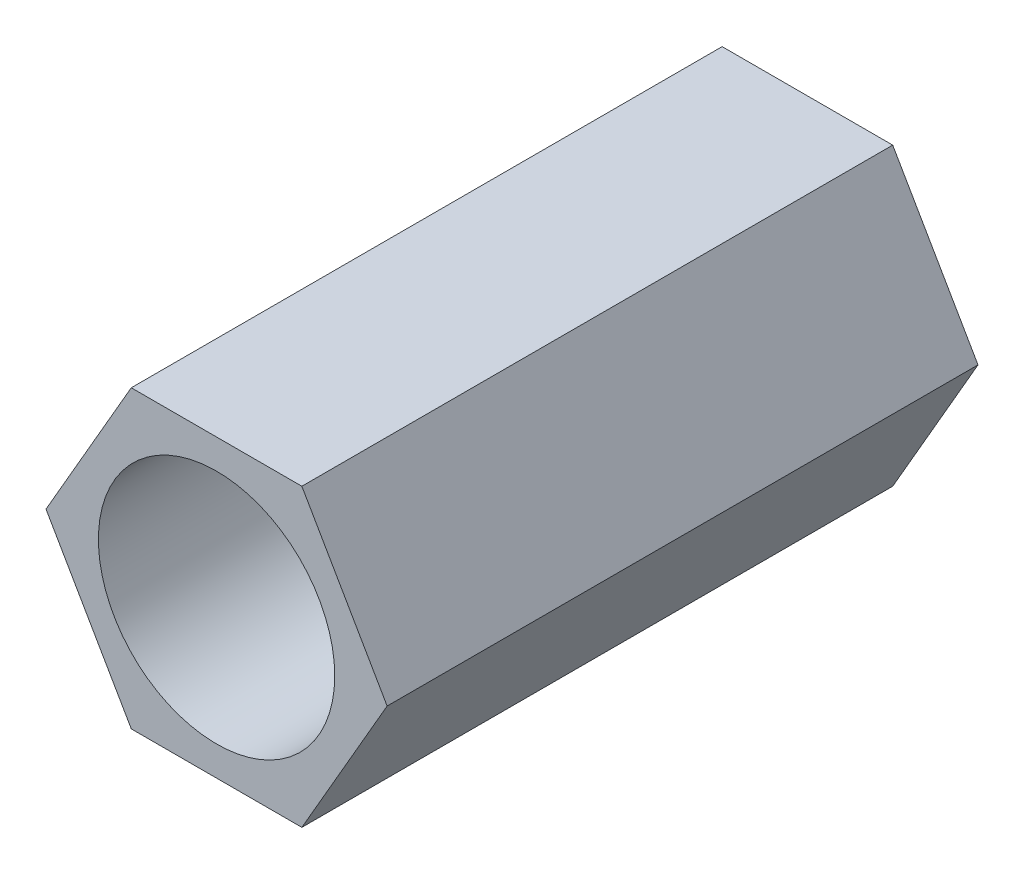
ISO-10303-21;
HEADER;
FILE_DESCRIPTION(('STEP AP214'),'2;1');
FILE_NAME('part.step','',(''),(''),'','','');
FILE_SCHEMA(('AUTOMOTIVE_DESIGN { 1 0 10303 214 1 1 1 1 }'));
ENDSEC;
DATA;
#1=APPLICATION_CONTEXT('core data for automotive mechanical design processes');
#2=APPLICATION_PROTOCOL_DEFINITION('international standard','automotive_design',2000,#1);
#3=PRODUCT_CONTEXT('',#1,'mechanical');
#4=PRODUCT('Part','Part','',(#3));
#5=PRODUCT_RELATED_PRODUCT_CATEGORY('part','',(#4));
#6=PRODUCT_DEFINITION_FORMATION('','',#4);
#7=PRODUCT_DEFINITION_CONTEXT('part definition',#1,'design');
#8=PRODUCT_DEFINITION('design','',#6,#7);
#9=PRODUCT_DEFINITION_SHAPE('','',#8);
#10=(LENGTH_UNIT() NAMED_UNIT(*) SI_UNIT(.MILLI.,.METRE.));
#11=(NAMED_UNIT(*) PLANE_ANGLE_UNIT() SI_UNIT($,.RADIAN.));
#12=(NAMED_UNIT(*) SI_UNIT($,.STERADIAN.) SOLID_ANGLE_UNIT());
#13=UNCERTAINTY_MEASURE_WITH_UNIT(LENGTH_MEASURE(1.E-05),#10,'distance_accuracy_value','');
#14=(GEOMETRIC_REPRESENTATION_CONTEXT(3) GLOBAL_UNCERTAINTY_ASSIGNED_CONTEXT((#13)) GLOBAL_UNIT_ASSIGNED_CONTEXT((#10,
#11,#12)) REPRESENTATION_CONTEXT('',''));
#15=CARTESIAN_POINT('',(0.,0.,0.));
#16=DIRECTION('',(0.,0.,1.));
#17=DIRECTION('',(1.,0.,0.));
#18=AXIS2_PLACEMENT_3D('',#15,#16,#17);
#19=CARTESIAN_POINT('',(2.88675134594818,-4.99999999999995,20.));
#20=DIRECTION('',(-0.866025403784442,0.499999999999995,0.));
#21=DIRECTION('',(-0.499999999999995,-0.866025403784442,0.));
#22=AXIS2_PLACEMENT_3D('',#19,#20,#21);
#23=PLANE('',#22);
#24=DIRECTION('',(0.499999999999995,0.866025403784442,0.));
#25=VECTOR('',#24,1.);
#26=CARTESIAN_POINT('',(2.88675134594818,-4.99999999999995,0.));
#27=LINE('',#26,#25);
#28=CARTESIAN_POINT('',(2.88675134594818,-4.99999999999995,0.));
#29=VERTEX_POINT('',#28);
#30=CARTESIAN_POINT('',(5.77350269189624,0.,0.));
#31=VERTEX_POINT('',#30);
#32=EDGE_CURVE('E131',#29,#31,#27,.T.);
#33=ORIENTED_EDGE('',*,*,#32,.T.);
#34=DIRECTION('',(0.,0.,-1.));
#35=VECTOR('',#34,1.);
#36=CARTESIAN_POINT('',(5.77350269189624,0.,20.));
#37=LINE('',#36,#35);
#38=CARTESIAN_POINT('',(5.77350269189624,0.,20.));
#39=VERTEX_POINT('',#38);
#40=EDGE_CURVE('E11',#39,#31,#37,.T.);
#41=ORIENTED_EDGE('',*,*,#40,.F.);
#42=DIRECTION('',(0.499999999999995,0.866025403784442,0.));
#43=VECTOR('',#42,1.);
#44=CARTESIAN_POINT('',(2.88675134594818,-4.99999999999995,20.));
#45=LINE('',#44,#43);
#46=CARTESIAN_POINT('',(2.88675134594818,-4.99999999999995,20.));
#47=VERTEX_POINT('',#46);
#48=EDGE_CURVE('E141',#47,#39,#45,.T.);
#49=ORIENTED_EDGE('',*,*,#48,.F.);
#50=DIRECTION('',(0.,0.,-1.));
#51=VECTOR('',#50,1.);
#52=CARTESIAN_POINT('',(2.88675134594818,-4.99999999999995,20.));
#53=LINE('',#52,#51);
#54=EDGE_CURVE('E118',#47,#29,#53,.T.);
#55=ORIENTED_EDGE('',*,*,#54,.T.);
#56=EDGE_LOOP('',(#33,#41,#49,#55));
#57=FACE_BOUND('',#56,.T.);
#58=ADVANCED_FACE('F37',(#57),#23,.F.);
#59=CARTESIAN_POINT('',(5.77350269189624,0.,20.));
#60=DIRECTION('',(-0.866025403784438,-0.500000000000001,0.));
#61=DIRECTION('',(0.500000000000001,-0.866025403784438,0.));
#62=AXIS2_PLACEMENT_3D('',#59,#60,#61);
#63=PLANE('',#62);
#64=DIRECTION('',(-0.500000000000001,0.866025403784438,0.));
#65=VECTOR('',#64,1.);
#66=CARTESIAN_POINT('',(5.77350269189624,0.,0.));
#67=LINE('',#66,#65);
#68=CARTESIAN_POINT('',(2.88675134594811,4.99999999999999,0.));
#69=VERTEX_POINT('',#68);
#70=EDGE_CURVE('E127',#31,#69,#67,.T.);
#71=ORIENTED_EDGE('',*,*,#70,.T.);
#72=DIRECTION('',(0.,0.,-1.));
#73=VECTOR('',#72,1.);
#74=CARTESIAN_POINT('',(2.88675134594811,4.99999999999999,20.));
#75=LINE('',#74,#73);
#76=CARTESIAN_POINT('',(2.88675134594811,4.99999999999999,20.));
#77=VERTEX_POINT('',#76);
#78=EDGE_CURVE('E45',#77,#69,#75,.T.);
#79=ORIENTED_EDGE('',*,*,#78,.F.);
#80=DIRECTION('',(-0.500000000000001,0.866025403784438,0.));
#81=VECTOR('',#80,1.);
#82=CARTESIAN_POINT('',(5.77350269189624,0.,20.));
#83=LINE('',#82,#81);
#84=EDGE_CURVE('E86',#39,#77,#83,.T.);
#85=ORIENTED_EDGE('',*,*,#84,.F.);
#86=ORIENTED_EDGE('',*,*,#40,.T.);
#87=EDGE_LOOP('',(#71,#79,#85,#86));
#88=FACE_BOUND('',#87,.T.);
#89=ADVANCED_FACE('F128',(#88),#63,.F.);
#90=CARTESIAN_POINT('',(2.88675134594811,4.99999999999999,20.));
#91=DIRECTION('',(0.,-1.,0.));
#92=DIRECTION('',(1.,0.,0.));
#93=AXIS2_PLACEMENT_3D('',#90,#91,#92);
#94=PLANE('',#93);
#95=DIRECTION('',(-1.,0.,0.));
#96=VECTOR('',#95,1.);
#97=CARTESIAN_POINT('',(2.88675134594811,4.99999999999999,0.));
#98=LINE('',#97,#96);
#99=CARTESIAN_POINT('',(-2.88675134594814,4.99999999999997,0.));
#100=VERTEX_POINT('',#99);
#101=EDGE_CURVE('E126',#69,#100,#98,.T.);
#102=ORIENTED_EDGE('',*,*,#101,.T.);
#103=DIRECTION('',(0.,0.,-1.));
#104=VECTOR('',#103,1.);
#105=CARTESIAN_POINT('',(-2.88675134594814,4.99999999999997,20.));
#106=LINE('',#105,#104);
#107=CARTESIAN_POINT('',(-2.88675134594814,4.99999999999997,20.));
#108=VERTEX_POINT('',#107);
#109=EDGE_CURVE('E115',#108,#100,#106,.T.);
#110=ORIENTED_EDGE('',*,*,#109,.F.);
#111=DIRECTION('',(-1.,0.,0.));
#112=VECTOR('',#111,1.);
#113=CARTESIAN_POINT('',(2.88675134594811,4.99999999999999,20.));
#114=LINE('',#113,#112);
#115=EDGE_CURVE('E108',#77,#108,#114,.T.);
#116=ORIENTED_EDGE('',*,*,#115,.F.);
#117=ORIENTED_EDGE('',*,*,#78,.T.);
#118=EDGE_LOOP('',(#102,#110,#116,#117));
#119=FACE_BOUND('',#118,.T.);
#120=ADVANCED_FACE('F125',(#119),#94,.F.);
#121=CARTESIAN_POINT('',(-2.88675134594814,4.99999999999997,20.));
#122=DIRECTION('',(0.866025403784442,-0.499999999999995,0.));
#123=DIRECTION('',(0.499999999999995,0.866025403784442,0.));
#124=AXIS2_PLACEMENT_3D('',#121,#122,#123);
#125=PLANE('',#124);
#126=DIRECTION('',(-0.499999999999995,-0.866025403784441,0.));
#127=VECTOR('',#126,1.);
#128=CARTESIAN_POINT('',(-2.88675134594814,4.99999999999997,0.));
#129=LINE('',#128,#127);
#130=CARTESIAN_POINT('',(-5.77350269189624,0.,0.));
#131=VERTEX_POINT('',#130);
#132=EDGE_CURVE('E114',#100,#131,#129,.T.);
#133=ORIENTED_EDGE('',*,*,#132,.T.);
#134=DIRECTION('',(0.,0.,-1.));
#135=VECTOR('',#134,1.);
#136=CARTESIAN_POINT('',(-5.77350269189624,0.,20.));
#137=LINE('',#136,#135);
#138=CARTESIAN_POINT('',(-5.77350269189624,0.,20.));
#139=VERTEX_POINT('',#138);
#140=EDGE_CURVE('E101',#139,#131,#137,.T.);
#141=ORIENTED_EDGE('',*,*,#140,.F.);
#142=DIRECTION('',(-0.499999999999995,-0.866025403784441,0.));
#143=VECTOR('',#142,1.);
#144=CARTESIAN_POINT('',(-2.88675134594814,4.99999999999997,20.));
#145=LINE('',#144,#143);
#146=EDGE_CURVE('E104',#108,#139,#145,.T.);
#147=ORIENTED_EDGE('',*,*,#146,.F.);
#148=ORIENTED_EDGE('',*,*,#109,.T.);
#149=EDGE_LOOP('',(#133,#141,#147,#148));
#150=FACE_BOUND('',#149,.T.);
#151=ADVANCED_FACE('F113',(#150),#125,.F.);
#152=CARTESIAN_POINT('',(-5.77350269189624,0.,20.));
#153=DIRECTION('',(0.866025403784434,0.500000000000007,0.));
#154=DIRECTION('',(-0.500000000000007,0.866025403784435,0.));
#155=AXIS2_PLACEMENT_3D('',#152,#153,#154);
#156=PLANE('',#155);
#157=DIRECTION('',(0.500000000000007,-0.866025403784434,0.));
#158=VECTOR('',#157,1.);
#159=CARTESIAN_POINT('',(-5.77350269189624,0.,0.));
#160=LINE('',#159,#158);
#161=CARTESIAN_POINT('',(-2.88675134594807,-5.00000000000001,0.));
#162=VERTEX_POINT('',#161);
#163=EDGE_CURVE('E139',#131,#162,#160,.T.);
#164=ORIENTED_EDGE('',*,*,#163,.T.);
#165=DIRECTION('',(0.,0.,-1.));
#166=VECTOR('',#165,1.);
#167=CARTESIAN_POINT('',(-2.88675134594807,-5.00000000000001,20.));
#168=LINE('',#167,#166);
#169=CARTESIAN_POINT('',(-2.88675134594807,-5.00000000000001,20.));
#170=VERTEX_POINT('',#169);
#171=EDGE_CURVE('E103',#170,#162,#168,.T.);
#172=ORIENTED_EDGE('',*,*,#171,.F.);
#173=DIRECTION('',(0.500000000000007,-0.866025403784434,0.));
#174=VECTOR('',#173,1.);
#175=CARTESIAN_POINT('',(-5.77350269189624,0.,20.));
#176=LINE('',#175,#174);
#177=EDGE_CURVE('E96',#139,#170,#176,.T.);
#178=ORIENTED_EDGE('',*,*,#177,.F.);
#179=ORIENTED_EDGE('',*,*,#140,.T.);
#180=EDGE_LOOP('',(#164,#172,#178,#179));
#181=FACE_BOUND('',#180,.T.);
#182=ADVANCED_FACE('F99',(#181),#156,.F.);
#183=CARTESIAN_POINT('',(-2.88675134594807,-5.00000000000001,20.));
#184=DIRECTION('',(0.,1.,0.));
#185=DIRECTION('',(-1.,0.,0.));
#186=AXIS2_PLACEMENT_3D('',#183,#184,#185);
#187=PLANE('',#186);
#188=DIRECTION('',(1.,0.,0.));
#189=VECTOR('',#188,1.);
#190=CARTESIAN_POINT('',(-2.88675134594807,-5.00000000000001,0.));
#191=LINE('',#190,#189);
#192=EDGE_CURVE('E75',#162,#29,#191,.T.);
#193=ORIENTED_EDGE('',*,*,#192,.T.);
#194=ORIENTED_EDGE('',*,*,#54,.F.);
#195=DIRECTION('',(1.,0.,0.));
#196=VECTOR('',#195,1.);
#197=CARTESIAN_POINT('',(-2.88675134594807,-5.00000000000001,20.));
#198=LINE('',#197,#196);
#199=EDGE_CURVE('E53',#170,#47,#198,.T.);
#200=ORIENTED_EDGE('',*,*,#199,.F.);
#201=ORIENTED_EDGE('',*,*,#171,.T.);
#202=EDGE_LOOP('',(#193,#194,#200,#201));
#203=FACE_BOUND('',#202,.T.);
#204=ADVANCED_FACE('F163',(#203),#187,.F.);
#205=CARTESIAN_POINT('',(0.,0.,20.));
#206=DIRECTION('',(0.,0.,1.));
#207=DIRECTION('',(1.,0.,0.));
#208=AXIS2_PLACEMENT_3D('',#205,#206,#207);
#209=PLANE('',#208);
#210=CARTESIAN_POINT('',(0.,0.,20.));
#211=DIRECTION('',(0.,0.,1.));
#212=DIRECTION('',(1.,0.,0.));
#213=AXIS2_PLACEMENT_3D('',#210,#211,#212);
#214=CIRCLE('',#213,4.);
#215=CARTESIAN_POINT('',(4.,0.,20.));
#216=VERTEX_POINT('',#215);
#217=EDGE_CURVE('E148',#216,#216,#214,.T.);
#218=ORIENTED_EDGE('',*,*,#217,.F.);
#219=EDGE_LOOP('',(#218));
#220=FACE_BOUND('',#219,.T.);
#221=ORIENTED_EDGE('',*,*,#48,.T.);
#222=ORIENTED_EDGE('',*,*,#84,.T.);
#223=ORIENTED_EDGE('',*,*,#115,.T.);
#224=ORIENTED_EDGE('',*,*,#146,.T.);
#225=ORIENTED_EDGE('',*,*,#177,.T.);
#226=ORIENTED_EDGE('',*,*,#199,.T.);
#227=EDGE_LOOP('',(#221,#222,#223,#224,#225,#226));
#228=FACE_BOUND('',#227,.T.);
#229=ADVANCED_FACE('F107',(#220,#228),#209,.T.);
#230=CARTESIAN_POINT('',(0.,0.,0.));
#231=DIRECTION('',(0.,0.,1.));
#232=DIRECTION('',(1.,0.,0.));
#233=AXIS2_PLACEMENT_3D('',#230,#231,#232);
#234=PLANE('',#233);
#235=CARTESIAN_POINT('',(0.,0.,0.));
#236=DIRECTION('',(0.,0.,1.));
#237=DIRECTION('',(1.,0.,0.));
#238=AXIS2_PLACEMENT_3D('',#235,#236,#237);
#239=CIRCLE('',#238,4.);
#240=CARTESIAN_POINT('',(4.,0.,0.));
#241=VERTEX_POINT('',#240);
#242=EDGE_CURVE('E134',#241,#241,#239,.T.);
#243=ORIENTED_EDGE('',*,*,#242,.T.);
#244=EDGE_LOOP('',(#243));
#245=FACE_BOUND('',#244,.T.);
#246=ORIENTED_EDGE('',*,*,#32,.F.);
#247=ORIENTED_EDGE('',*,*,#192,.F.);
#248=ORIENTED_EDGE('',*,*,#163,.F.);
#249=ORIENTED_EDGE('',*,*,#132,.F.);
#250=ORIENTED_EDGE('',*,*,#101,.F.);
#251=ORIENTED_EDGE('',*,*,#70,.F.);
#252=EDGE_LOOP('',(#246,#247,#248,#249,#250,#251));
#253=FACE_BOUND('',#252,.T.);
#254=ADVANCED_FACE('F154',(#245,#253),#234,.F.);
#255=CARTESIAN_POINT('',(0.,0.,0.));
#256=DIRECTION('',(0.,0.,1.));
#257=DIRECTION('',(1.,0.,0.));
#258=AXIS2_PLACEMENT_3D('',#255,#256,#257);
#259=CYLINDRICAL_SURFACE('',#258,4.);
#260=ORIENTED_EDGE('',*,*,#242,.F.);
#261=EDGE_LOOP('',(#260));
#262=FACE_BOUND('',#261,.T.);
#263=ORIENTED_EDGE('',*,*,#217,.T.);
#264=EDGE_LOOP('',(#263));
#265=FACE_BOUND('',#264,.T.);
#266=ADVANCED_FACE('F156',(#262,#265),#259,.F.);
#267=CLOSED_SHELL('',(#58,#89,#120,#151,#182,#204,#229,#254,#266));
#268=MANIFOLD_SOLID_BREP('B2',#267);
#269=ADVANCED_BREP_SHAPE_REPRESENTATION('',(#18,#268),#14);
#270=SHAPE_DEFINITION_REPRESENTATION(#9,#269);
ENDSEC;
END-ISO-10303-21;
